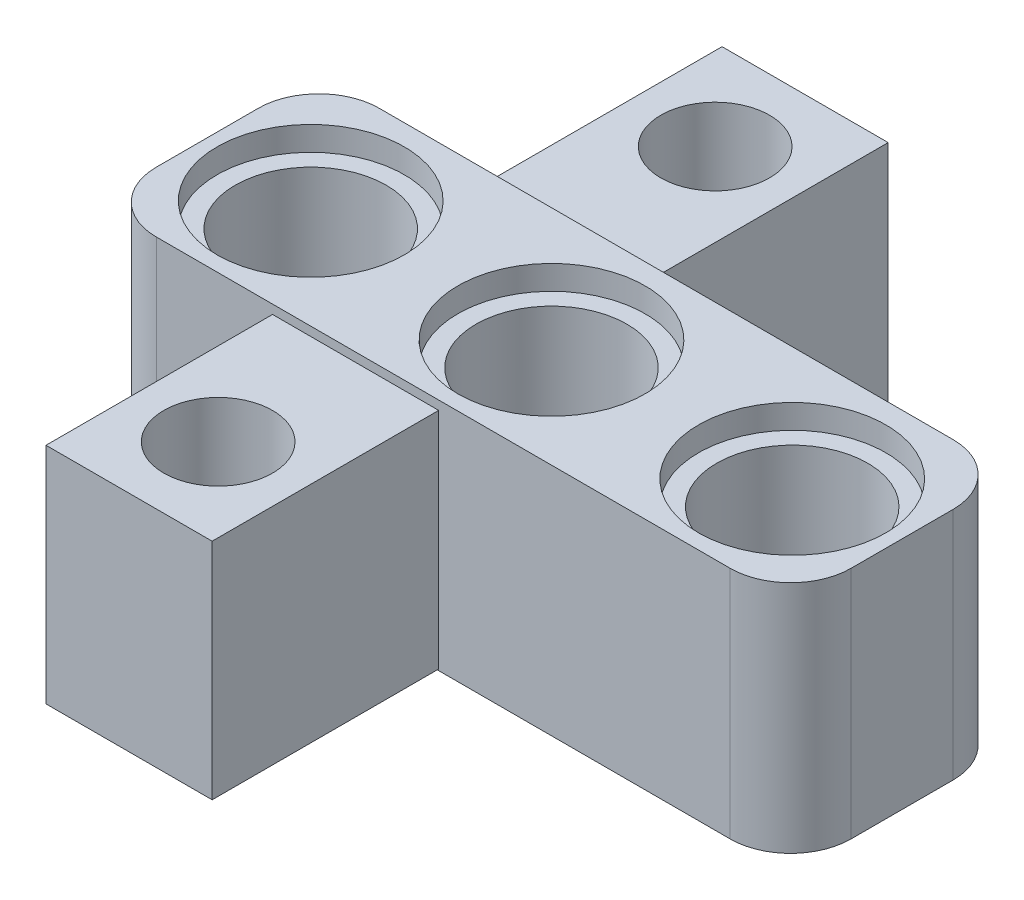
ISO-10303-21;
HEADER;
FILE_DESCRIPTION(('STEP AP214'),'2;1');
FILE_NAME('part.step','',(''),(''),'','','');
FILE_SCHEMA(('AUTOMOTIVE_DESIGN { 1 0 10303 214 1 1 1 1 }'));
ENDSEC;
DATA;
#1=APPLICATION_CONTEXT('core data for automotive mechanical design processes');
#2=APPLICATION_PROTOCOL_DEFINITION('international standard','automotive_design',2000,#1);
#3=PRODUCT_CONTEXT('',#1,'mechanical');
#4=PRODUCT('Part','Part','',(#3));
#5=PRODUCT_RELATED_PRODUCT_CATEGORY('part','',(#4));
#6=PRODUCT_DEFINITION_FORMATION('','',#4);
#7=PRODUCT_DEFINITION_CONTEXT('part definition',#1,'design');
#8=PRODUCT_DEFINITION('design','',#6,#7);
#9=PRODUCT_DEFINITION_SHAPE('','',#8);
#10=(LENGTH_UNIT() NAMED_UNIT(*) SI_UNIT(.MILLI.,.METRE.));
#11=(NAMED_UNIT(*) PLANE_ANGLE_UNIT() SI_UNIT($,.RADIAN.));
#12=(NAMED_UNIT(*) SI_UNIT($,.STERADIAN.) SOLID_ANGLE_UNIT());
#13=UNCERTAINTY_MEASURE_WITH_UNIT(LENGTH_MEASURE(1.E-05),#10,'distance_accuracy_value','');
#14=(GEOMETRIC_REPRESENTATION_CONTEXT(3) GLOBAL_UNCERTAINTY_ASSIGNED_CONTEXT((#13)) GLOBAL_UNIT_ASSIGNED_CONTEXT((#10,
#11,#12)) REPRESENTATION_CONTEXT('',''));
#15=CARTESIAN_POINT('',(0.,0.,0.));
#16=DIRECTION('',(0.,0.,1.));
#17=DIRECTION('',(1.,0.,0.));
#18=AXIS2_PLACEMENT_3D('',#15,#16,#17);
#19=CARTESIAN_POINT('',(0.,7.76,0.));
#20=DIRECTION('',(0.,0.,-1.));
#21=DIRECTION('',(-1.,0.,0.));
#22=AXIS2_PLACEMENT_3D('',#19,#20,#21);
#23=PLANE('',#22);
#24=DIRECTION('',(1.,0.,0.));
#25=VECTOR('',#24,1.);
#26=CARTESIAN_POINT('',(0.,7.76,0.));
#27=LINE('',#26,#25);
#28=CARTESIAN_POINT('',(-21.,7.76,0.));
#29=VERTEX_POINT('',#28);
#30=CARTESIAN_POINT('',(-2.,7.76,0.));
#31=VERTEX_POINT('',#30);
#32=EDGE_CURVE('E238',#29,#31,#27,.T.);
#33=ORIENTED_EDGE('',*,*,#32,.F.);
#34=DIRECTION('',(0.,1.,0.));
#35=VECTOR('',#34,1.);
#36=CARTESIAN_POINT('',(-21.,7.76,0.));
#37=LINE('',#36,#35);
#38=CARTESIAN_POINT('',(-21.,0.,0.));
#39=VERTEX_POINT('',#38);
#40=EDGE_CURVE('E221',#29,#39,#37,.F.);
#41=ORIENTED_EDGE('',*,*,#40,.T.);
#42=DIRECTION('',(1.,0.,0.));
#43=VECTOR('',#42,1.);
#44=CARTESIAN_POINT('',(0.,0.,0.));
#45=LINE('',#44,#43);
#46=CARTESIAN_POINT('',(-2.,0.,0.));
#47=VERTEX_POINT('',#46);
#48=EDGE_CURVE('E249',#39,#47,#45,.T.);
#49=ORIENTED_EDGE('',*,*,#48,.T.);
#50=DIRECTION('',(0.,-1.,0.));
#51=VECTOR('',#50,1.);
#52=CARTESIAN_POINT('',(-2.,7.76,0.));
#53=LINE('',#52,#51);
#54=EDGE_CURVE('E232',#47,#31,#53,.F.);
#55=ORIENTED_EDGE('',*,*,#54,.T.);
#56=EDGE_LOOP('',(#33,#41,#49,#55));
#57=FACE_BOUND('',#56,.T.);
#58=DIRECTION('',(0.,-1.,0.));
#59=VECTOR('',#58,1.);
#60=CARTESIAN_POINT('',(-17.15,7.46280802617594,0.));
#61=LINE('',#60,#59);
#62=CARTESIAN_POINT('',(-17.15,7.46280802617594,0.));
#63=VERTEX_POINT('',#62);
#64=CARTESIAN_POINT('',(-17.15,0.0473093664368207,0.));
#65=VERTEX_POINT('',#64);
#66=EDGE_CURVE('E361',#63,#65,#61,.T.);
#67=ORIENTED_EDGE('',*,*,#66,.F.);
#68=DIRECTION('',(-1.,0.,0.));
#69=VECTOR('',#68,1.);
#70=CARTESIAN_POINT('',(-17.15,7.46280802617594,0.));
#71=LINE('',#70,#69);
#72=CARTESIAN_POINT('',(-11.65,7.46280802617594,0.));
#73=VERTEX_POINT('',#72);
#74=EDGE_CURVE('E353',#73,#63,#71,.T.);
#75=ORIENTED_EDGE('',*,*,#74,.F.);
#76=DIRECTION('',(0.,1.,0.));
#77=VECTOR('',#76,1.);
#78=CARTESIAN_POINT('',(-11.65,7.46280802617594,0.));
#79=LINE('',#78,#77);
#80=CARTESIAN_POINT('',(-11.65,0.0473093664368207,0.));
#81=VERTEX_POINT('',#80);
#82=EDGE_CURVE('E357',#81,#73,#79,.T.);
#83=ORIENTED_EDGE('',*,*,#82,.F.);
#84=DIRECTION('',(1.,0.,0.));
#85=VECTOR('',#84,1.);
#86=CARTESIAN_POINT('',(-17.15,0.0473093664368207,0.));
#87=LINE('',#86,#85);
#88=EDGE_CURVE('E54',#65,#81,#87,.T.);
#89=ORIENTED_EDGE('',*,*,#88,.F.);
#90=EDGE_LOOP('',(#67,#75,#83,#89));
#91=FACE_BOUND('',#90,.T.);
#92=ADVANCED_FACE('F32',(#57,#91),#23,.F.);
#93=CARTESIAN_POINT('',(0.,7.76,-7.38));
#94=DIRECTION('',(0.,0.,1.));
#95=DIRECTION('',(1.,0.,0.));
#96=AXIS2_PLACEMENT_3D('',#93,#94,#95);
#97=PLANE('',#96);
#98=DIRECTION('',(-1.,0.,0.));
#99=VECTOR('',#98,1.);
#100=CARTESIAN_POINT('',(0.,7.76,-7.38));
#101=LINE('',#100,#99);
#102=CARTESIAN_POINT('',(-2.,7.76,-7.38));
#103=VERTEX_POINT('',#102);
#104=CARTESIAN_POINT('',(-21.,7.76,-7.38));
#105=VERTEX_POINT('',#104);
#106=EDGE_CURVE('E263',#103,#105,#101,.T.);
#107=ORIENTED_EDGE('',*,*,#106,.F.);
#108=DIRECTION('',(0.,-1.,0.));
#109=VECTOR('',#108,1.);
#110=CARTESIAN_POINT('',(-2.,7.76,-7.38));
#111=LINE('',#110,#109);
#112=CARTESIAN_POINT('',(-2.,0.,-7.38));
#113=VERTEX_POINT('',#112);
#114=EDGE_CURVE('E202',#103,#113,#111,.T.);
#115=ORIENTED_EDGE('',*,*,#114,.T.);
#116=DIRECTION('',(-1.,0.,0.));
#117=VECTOR('',#116,1.);
#118=CARTESIAN_POINT('',(0.,0.,-7.38));
#119=LINE('',#118,#117);
#120=CARTESIAN_POINT('',(-21.,0.,-7.38));
#121=VERTEX_POINT('',#120);
#122=EDGE_CURVE('E254',#113,#121,#119,.T.);
#123=ORIENTED_EDGE('',*,*,#122,.T.);
#124=DIRECTION('',(0.,1.,0.));
#125=VECTOR('',#124,1.);
#126=CARTESIAN_POINT('',(-21.,7.76,-7.38));
#127=LINE('',#126,#125);
#128=EDGE_CURVE('E213',#121,#105,#127,.T.);
#129=ORIENTED_EDGE('',*,*,#128,.T.);
#130=EDGE_LOOP('',(#107,#115,#123,#129));
#131=FACE_BOUND('',#130,.T.);
#132=DIRECTION('',(0.,-1.,0.));
#133=VECTOR('',#132,1.);
#134=CARTESIAN_POINT('',(-11.65,0.19970973212935,-7.38));
#135=LINE('',#134,#133);
#136=CARTESIAN_POINT('',(-11.65,7.70025145904174,-7.38));
#137=VERTEX_POINT('',#136);
#138=CARTESIAN_POINT('',(-11.65,0.19970973212935,-7.38));
#139=VERTEX_POINT('',#138);
#140=EDGE_CURVE('E331',#137,#139,#135,.T.);
#141=ORIENTED_EDGE('',*,*,#140,.F.);
#142=DIRECTION('',(1.,0.,0.));
#143=VECTOR('',#142,1.);
#144=CARTESIAN_POINT('',(-11.65,7.70025145904174,-7.38));
#145=LINE('',#144,#143);
#146=CARTESIAN_POINT('',(-17.15,7.70025145904174,-7.38));
#147=VERTEX_POINT('',#146);
#148=EDGE_CURVE('E321',#147,#137,#145,.T.);
#149=ORIENTED_EDGE('',*,*,#148,.F.);
#150=DIRECTION('',(0.,1.,0.));
#151=VECTOR('',#150,1.);
#152=CARTESIAN_POINT('',(-17.15,0.19970973212935,-7.38));
#153=LINE('',#152,#151);
#154=CARTESIAN_POINT('',(-17.15,0.19970973212935,-7.38));
#155=VERTEX_POINT('',#154);
#156=EDGE_CURVE('E325',#155,#147,#153,.T.);
#157=ORIENTED_EDGE('',*,*,#156,.F.);
#158=DIRECTION('',(-1.,0.,0.));
#159=VECTOR('',#158,1.);
#160=CARTESIAN_POINT('',(-11.65,0.19970973212935,-7.38));
#161=LINE('',#160,#159);
#162=EDGE_CURVE('E328',#139,#155,#161,.T.);
#163=ORIENTED_EDGE('',*,*,#162,.F.);
#164=EDGE_LOOP('',(#141,#149,#157,#163));
#165=FACE_BOUND('',#164,.T.);
#166=ADVANCED_FACE('F427',(#131,#165),#97,.F.);
#167=CARTESIAN_POINT('',(-2.,7.76,-5.38));
#168=DIRECTION('',(0.,-1.,0.));
#169=DIRECTION('',(0.,0.,-1.));
#170=AXIS2_PLACEMENT_3D('',#167,#168,#169);
#171=CYLINDRICAL_SURFACE('',#170,2.);
#172=ORIENTED_EDGE('',*,*,#114,.F.);
#173=CARTESIAN_POINT('',(-2.,7.76,-5.38));
#174=DIRECTION('',(0.,1.,0.));
#175=DIRECTION('',(0.,0.,1.));
#176=AXIS2_PLACEMENT_3D('',#173,#174,#175);
#177=CIRCLE('',#176,2.);
#178=CARTESIAN_POINT('',(0.,7.76,-5.38));
#179=VERTEX_POINT('',#178);
#180=EDGE_CURVE('E197',#179,#103,#177,.T.);
#181=ORIENTED_EDGE('',*,*,#180,.F.);
#182=DIRECTION('',(0.,-1.,0.));
#183=VECTOR('',#182,1.);
#184=CARTESIAN_POINT('',(0.,7.76,-5.38));
#185=LINE('',#184,#183);
#186=CARTESIAN_POINT('',(0.,0.,-5.38));
#187=VERTEX_POINT('',#186);
#188=EDGE_CURVE('E199',#187,#179,#185,.F.);
#189=ORIENTED_EDGE('',*,*,#188,.F.);
#190=CARTESIAN_POINT('',(-2.,0.,-5.38));
#191=DIRECTION('',(0.,1.,0.));
#192=DIRECTION('',(0.,0.,1.));
#193=AXIS2_PLACEMENT_3D('',#190,#191,#192);
#194=CIRCLE('',#193,2.);
#195=EDGE_CURVE('E183',#113,#187,#194,.F.);
#196=ORIENTED_EDGE('',*,*,#195,.F.);
#197=EDGE_LOOP('',(#172,#181,#189,#196));
#198=FACE_BOUND('',#197,.T.);
#199=ADVANCED_FACE('F34',(#198),#171,.T.);
#200=CARTESIAN_POINT('',(-21.,7.76,-5.38));
#201=DIRECTION('',(0.,1.,0.));
#202=DIRECTION('',(0.,0.,1.));
#203=AXIS2_PLACEMENT_3D('',#200,#201,#202);
#204=CYLINDRICAL_SURFACE('',#203,2.);
#205=ORIENTED_EDGE('',*,*,#128,.F.);
#206=CARTESIAN_POINT('',(-21.,0.,-5.38));
#207=DIRECTION('',(0.,1.,0.));
#208=DIRECTION('',(0.,0.,1.));
#209=AXIS2_PLACEMENT_3D('',#206,#207,#208);
#210=CIRCLE('',#209,2.);
#211=CARTESIAN_POINT('',(-23.,0.,-5.38));
#212=VERTEX_POINT('',#211);
#213=EDGE_CURVE('E207',#212,#121,#210,.F.);
#214=ORIENTED_EDGE('',*,*,#213,.F.);
#215=DIRECTION('',(0.,1.,0.));
#216=VECTOR('',#215,1.);
#217=CARTESIAN_POINT('',(-23.,7.76,-5.38));
#218=LINE('',#217,#216);
#219=CARTESIAN_POINT('',(-23.,7.76,-5.38));
#220=VERTEX_POINT('',#219);
#221=EDGE_CURVE('E210',#220,#212,#218,.F.);
#222=ORIENTED_EDGE('',*,*,#221,.F.);
#223=CARTESIAN_POINT('',(-21.,7.76,-5.38));
#224=DIRECTION('',(0.,1.,0.));
#225=DIRECTION('',(0.,0.,1.));
#226=AXIS2_PLACEMENT_3D('',#223,#224,#225);
#227=CIRCLE('',#226,2.);
#228=EDGE_CURVE('E205',#105,#220,#227,.T.);
#229=ORIENTED_EDGE('',*,*,#228,.F.);
#230=EDGE_LOOP('',(#205,#214,#222,#229));
#231=FACE_BOUND('',#230,.T.);
#232=ADVANCED_FACE('F454',(#231),#204,.T.);
#233=CARTESIAN_POINT('',(-21.,7.76,-2.));
#234=DIRECTION('',(0.,1.,0.));
#235=DIRECTION('',(0.,0.,1.));
#236=AXIS2_PLACEMENT_3D('',#233,#234,#235);
#237=CYLINDRICAL_SURFACE('',#236,2.);
#238=DIRECTION('',(0.,1.,0.));
#239=VECTOR('',#238,1.);
#240=CARTESIAN_POINT('',(-23.,7.76,-2.));
#241=LINE('',#240,#239);
#242=CARTESIAN_POINT('',(-23.,0.,-2.));
#243=VERTEX_POINT('',#242);
#244=CARTESIAN_POINT('',(-23.,7.76,-2.));
#245=VERTEX_POINT('',#244);
#246=EDGE_CURVE('E224',#243,#245,#241,.T.);
#247=ORIENTED_EDGE('',*,*,#246,.F.);
#248=CARTESIAN_POINT('',(-21.,0.,-2.));
#249=DIRECTION('',(0.,1.,0.));
#250=DIRECTION('',(0.,0.,1.));
#251=AXIS2_PLACEMENT_3D('',#248,#249,#250);
#252=CIRCLE('',#251,2.);
#253=EDGE_CURVE('E218',#39,#243,#252,.F.);
#254=ORIENTED_EDGE('',*,*,#253,.F.);
#255=ORIENTED_EDGE('',*,*,#40,.F.);
#256=CARTESIAN_POINT('',(-21.,7.76,-2.));
#257=DIRECTION('',(0.,1.,0.));
#258=DIRECTION('',(0.,0.,1.));
#259=AXIS2_PLACEMENT_3D('',#256,#257,#258);
#260=CIRCLE('',#259,2.);
#261=EDGE_CURVE('E216',#245,#29,#260,.T.);
#262=ORIENTED_EDGE('',*,*,#261,.F.);
#263=EDGE_LOOP('',(#247,#254,#255,#262));
#264=FACE_BOUND('',#263,.T.);
#265=ADVANCED_FACE('F451',(#264),#237,.T.);
#266=CARTESIAN_POINT('',(-2.,7.76,-2.));
#267=DIRECTION('',(0.,-1.,0.));
#268=DIRECTION('',(0.,0.,-1.));
#269=AXIS2_PLACEMENT_3D('',#266,#267,#268);
#270=CYLINDRICAL_SURFACE('',#269,2.);
#271=DIRECTION('',(0.,-1.,0.));
#272=VECTOR('',#271,1.);
#273=CARTESIAN_POINT('',(0.,7.76,-2.));
#274=LINE('',#273,#272);
#275=CARTESIAN_POINT('',(0.,7.76,-2.));
#276=VERTEX_POINT('',#275);
#277=CARTESIAN_POINT('',(0.,0.,-2.));
#278=VERTEX_POINT('',#277);
#279=EDGE_CURVE('E235',#276,#278,#274,.T.);
#280=ORIENTED_EDGE('',*,*,#279,.F.);
#281=CARTESIAN_POINT('',(-2.,7.76,-2.));
#282=DIRECTION('',(0.,1.,0.));
#283=DIRECTION('',(0.,0.,1.));
#284=AXIS2_PLACEMENT_3D('',#281,#282,#283);
#285=CIRCLE('',#284,2.);
#286=EDGE_CURVE('E230',#31,#276,#285,.T.);
#287=ORIENTED_EDGE('',*,*,#286,.F.);
#288=ORIENTED_EDGE('',*,*,#54,.F.);
#289=CARTESIAN_POINT('',(-2.,0.,-2.));
#290=DIRECTION('',(0.,1.,0.));
#291=DIRECTION('',(0.,0.,1.));
#292=AXIS2_PLACEMENT_3D('',#289,#290,#291);
#293=CIRCLE('',#292,2.);
#294=EDGE_CURVE('E227',#278,#47,#293,.F.);
#295=ORIENTED_EDGE('',*,*,#294,.F.);
#296=EDGE_LOOP('',(#280,#287,#288,#295));
#297=FACE_BOUND('',#296,.T.);
#298=ADVANCED_FACE('F447',(#297),#270,.T.);
#299=CARTESIAN_POINT('',(0.,7.76,0.));
#300=DIRECTION('',(-1.,0.,0.));
#301=DIRECTION('',(0.,0.,1.));
#302=AXIS2_PLACEMENT_3D('',#299,#300,#301);
#303=PLANE('',#302);
#304=DIRECTION('',(0.,0.,-1.));
#305=VECTOR('',#304,1.);
#306=CARTESIAN_POINT('',(0.,0.,0.));
#307=LINE('',#306,#305);
#308=EDGE_CURVE('E256',#278,#187,#307,.T.);
#309=ORIENTED_EDGE('',*,*,#308,.T.);
#310=ORIENTED_EDGE('',*,*,#188,.T.);
#311=DIRECTION('',(0.,0.,-1.));
#312=VECTOR('',#311,1.);
#313=CARTESIAN_POINT('',(0.,7.76,0.));
#314=LINE('',#313,#312);
#315=EDGE_CURVE('E251',#276,#179,#314,.T.);
#316=ORIENTED_EDGE('',*,*,#315,.F.);
#317=ORIENTED_EDGE('',*,*,#279,.T.);
#318=EDGE_LOOP('',(#309,#310,#316,#317));
#319=FACE_BOUND('',#318,.T.);
#320=ADVANCED_FACE('F442',(#319),#303,.F.);
#321=CARTESIAN_POINT('',(-23.,7.76,0.));
#322=DIRECTION('',(1.,0.,0.));
#323=DIRECTION('',(0.,0.,-1.));
#324=AXIS2_PLACEMENT_3D('',#321,#322,#323);
#325=PLANE('',#324);
#326=DIRECTION('',(0.,0.,1.));
#327=VECTOR('',#326,1.);
#328=CARTESIAN_POINT('',(-23.,7.76,0.));
#329=LINE('',#328,#327);
#330=EDGE_CURVE('E261',#220,#245,#329,.T.);
#331=ORIENTED_EDGE('',*,*,#330,.F.);
#332=ORIENTED_EDGE('',*,*,#221,.T.);
#333=DIRECTION('',(0.,0.,1.));
#334=VECTOR('',#333,1.);
#335=CARTESIAN_POINT('',(-23.,0.,0.));
#336=LINE('',#335,#334);
#337=EDGE_CURVE('E252',#212,#243,#336,.T.);
#338=ORIENTED_EDGE('',*,*,#337,.T.);
#339=ORIENTED_EDGE('',*,*,#246,.T.);
#340=EDGE_LOOP('',(#331,#332,#338,#339));
#341=FACE_BOUND('',#340,.T.);
#342=ADVANCED_FACE('F439',(#341),#325,.F.);
#343=CARTESIAN_POINT('',(0.,7.76,0.));
#344=DIRECTION('',(0.,1.,0.));
#345=DIRECTION('',(0.,0.,1.));
#346=AXIS2_PLACEMENT_3D('',#343,#344,#345);
#347=PLANE('',#346);
#348=CARTESIAN_POINT('',(-19.4782694052837,7.76,-3.59147010718175));
#349=DIRECTION('',(0.,1.,0.));
#350=DIRECTION('',(0.,0.,1.));
#351=AXIS2_PLACEMENT_3D('',#348,#349,#350);
#352=CIRCLE('',#351,3.1);
#353=CARTESIAN_POINT('',(-19.4782694052837,7.76,-0.49147010718175));
#354=VERTEX_POINT('',#353);
#355=EDGE_CURVE('E296',#354,#354,#352,.T.);
#356=ORIENTED_EDGE('',*,*,#355,.F.);
#357=EDGE_LOOP('',(#356));
#358=FACE_BOUND('',#357,.T.);
#359=CARTESIAN_POINT('',(-11.5082694052837,7.76,-3.59147010718175));
#360=DIRECTION('',(0.,1.,0.));
#361=DIRECTION('',(0.,0.,1.));
#362=AXIS2_PLACEMENT_3D('',#359,#360,#361);
#363=CIRCLE('',#362,3.1);
#364=CARTESIAN_POINT('',(-11.5082694052837,7.76,-0.49147010718175));
#365=VERTEX_POINT('',#364);
#366=EDGE_CURVE('E290',#365,#365,#363,.T.);
#367=ORIENTED_EDGE('',*,*,#366,.F.);
#368=EDGE_LOOP('',(#367));
#369=FACE_BOUND('',#368,.T.);
#370=CARTESIAN_POINT('',(-3.53826940528369,7.76,-3.59147010718175));
#371=DIRECTION('',(0.,1.,0.));
#372=DIRECTION('',(0.,0.,1.));
#373=AXIS2_PLACEMENT_3D('',#370,#371,#372);
#374=CIRCLE('',#373,3.1);
#375=CARTESIAN_POINT('',(-3.53826940528369,7.76,-0.49147010718175));
#376=VERTEX_POINT('',#375);
#377=EDGE_CURVE('E242',#376,#376,#374,.T.);
#378=ORIENTED_EDGE('',*,*,#377,.F.);
#379=EDGE_LOOP('',(#378));
#380=FACE_BOUND('',#379,.T.);
#381=ORIENTED_EDGE('',*,*,#315,.T.);
#382=ORIENTED_EDGE('',*,*,#180,.T.);
#383=ORIENTED_EDGE('',*,*,#106,.T.);
#384=ORIENTED_EDGE('',*,*,#228,.T.);
#385=ORIENTED_EDGE('',*,*,#330,.T.);
#386=ORIENTED_EDGE('',*,*,#261,.T.);
#387=ORIENTED_EDGE('',*,*,#32,.T.);
#388=ORIENTED_EDGE('',*,*,#286,.T.);
#389=EDGE_LOOP('',(#381,#382,#383,#384,#385,#386,#387,#388));
#390=FACE_BOUND('',#389,.T.);
#391=ADVANCED_FACE('F441',(#358,#369,#380,#390),#347,.T.);
#392=CARTESIAN_POINT('',(0.,0.,0.));
#393=DIRECTION('',(0.,1.,0.));
#394=DIRECTION('',(0.,0.,1.));
#395=AXIS2_PLACEMENT_3D('',#392,#393,#394);
#396=PLANE('',#395);
#397=CARTESIAN_POINT('',(-19.5382694052837,0.,-3.69));
#398=DIRECTION('',(0.,-1.,0.));
#399=DIRECTION('',(0.,0.,-1.));
#400=AXIS2_PLACEMENT_3D('',#397,#398,#399);
#401=CIRCLE('',#400,3.1);
#402=CARTESIAN_POINT('',(-19.5382694052837,0.,-6.79));
#403=VERTEX_POINT('',#402);
#404=EDGE_CURVE('E280',#403,#403,#401,.T.);
#405=ORIENTED_EDGE('',*,*,#404,.F.);
#406=EDGE_LOOP('',(#405));
#407=FACE_BOUND('',#406,.T.);
#408=CARTESIAN_POINT('',(-3.53826940528369,0.,-3.68999999999989));
#409=DIRECTION('',(0.,-1.,0.));
#410=DIRECTION('',(0.,0.,-1.));
#411=AXIS2_PLACEMENT_3D('',#408,#409,#410);
#412=CIRCLE('',#411,3.1);
#413=CARTESIAN_POINT('',(-5.78504359883208,0.,-5.82588523174924));
#414=VERTEX_POINT('',#413);
#415=CARTESIAN_POINT('',(-5.78504359883208,0.,-1.55411476825053));
#416=VERTEX_POINT('',#415);
#417=EDGE_CURVE('E267',#414,#416,#412,.T.);
#418=ORIENTED_EDGE('',*,*,#417,.F.);
#419=CARTESIAN_POINT('',(-6.63826940528369,0.,-3.68999999999989));
#420=DIRECTION('',(0.,-1.,0.));
#421=DIRECTION('',(0.,0.,-1.));
#422=AXIS2_PLACEMENT_3D('',#419,#420,#421);
#423=CIRCLE('',#422,2.3);
#424=CARTESIAN_POINT('',(-8.64745307875307,0.,-4.80945565622933));
#425=VERTEX_POINT('',#424);
#426=EDGE_CURVE('E399',#425,#414,#423,.T.);
#427=ORIENTED_EDGE('',*,*,#426,.F.);
#428=CARTESIAN_POINT('',(-11.5382694052837,0.,-3.68999999999994));
#429=DIRECTION('',(0.,-1.,0.));
#430=DIRECTION('',(0.,0.,-1.));
#431=AXIS2_PLACEMENT_3D('',#428,#429,#430);
#432=CIRCLE('',#431,3.1);
#433=CARTESIAN_POINT('',(-8.64745307875309,0.,-2.57054434377049));
#434=VERTEX_POINT('',#433);
#435=EDGE_CURVE('E274',#434,#425,#432,.T.);
#436=ORIENTED_EDGE('',*,*,#435,.F.);
#437=EDGE_CURVE('E189',#416,#434,#423,.T.);
#438=ORIENTED_EDGE('',*,*,#437,.F.);
#439=EDGE_LOOP('',(#418,#427,#436,#438));
#440=FACE_BOUND('',#439,.T.);
#441=ORIENTED_EDGE('',*,*,#122,.F.);
#442=ORIENTED_EDGE('',*,*,#195,.T.);
#443=ORIENTED_EDGE('',*,*,#308,.F.);
#444=ORIENTED_EDGE('',*,*,#294,.T.);
#445=ORIENTED_EDGE('',*,*,#48,.F.);
#446=ORIENTED_EDGE('',*,*,#253,.T.);
#447=ORIENTED_EDGE('',*,*,#337,.F.);
#448=ORIENTED_EDGE('',*,*,#213,.T.);
#449=EDGE_LOOP('',(#441,#442,#443,#444,#445,#446,#447,#448));
#450=FACE_BOUND('',#449,.T.);
#451=ADVANCED_FACE('F409',(#407,#440,#450),#396,.F.);
#452=CARTESIAN_POINT('',(-3.53826940528369,0.8,-3.68999999999989));
#453=DIRECTION('',(0.,-1.,0.));
#454=DIRECTION('',(0.,0.,-1.));
#455=AXIS2_PLACEMENT_3D('',#452,#453,#454);
#456=CYLINDRICAL_SURFACE('',#455,3.1);
#457=CARTESIAN_POINT('',(-3.53826940528369,0.8,-3.68999999999989));
#458=DIRECTION('',(0.,-1.,0.));
#459=DIRECTION('',(0.,0.,-1.));
#460=AXIS2_PLACEMENT_3D('',#457,#458,#459);
#461=CIRCLE('',#460,3.1);
#462=CARTESIAN_POINT('',(-5.78504359883208,0.8,-5.82588523174924));
#463=VERTEX_POINT('',#462);
#464=CARTESIAN_POINT('',(-5.78504359883208,0.8,-1.55411476825053));
#465=VERTEX_POINT('',#464);
#466=EDGE_CURVE('E270',#463,#465,#461,.T.);
#467=ORIENTED_EDGE('',*,*,#466,.F.);
#468=DIRECTION('',(0.,-1.,0.));
#469=VECTOR('',#468,1.);
#470=CARTESIAN_POINT('',(-5.78504359883208,1.25,-5.82588523174924));
#471=LINE('',#470,#469);
#472=EDGE_CURVE('E391',#463,#414,#471,.T.);
#473=ORIENTED_EDGE('',*,*,#472,.T.);
#474=ORIENTED_EDGE('',*,*,#417,.T.);
#475=DIRECTION('',(0.,-1.,0.));
#476=VECTOR('',#475,1.);
#477=CARTESIAN_POINT('',(-5.78504359883208,1.25,-1.55411476825053));
#478=LINE('',#477,#476);
#479=EDGE_CURVE('E395',#416,#465,#478,.F.);
#480=ORIENTED_EDGE('',*,*,#479,.T.);
#481=EDGE_LOOP('',(#467,#473,#474,#480));
#482=FACE_BOUND('',#481,.T.);
#483=ADVANCED_FACE('F413',(#482),#456,.F.);
#484=CARTESIAN_POINT('',(-3.53826940528369,0.8,-3.68999999999989));
#485=DIRECTION('',(0.,-1.,0.));
#486=DIRECTION('',(0.,0.,-1.));
#487=AXIS2_PLACEMENT_3D('',#484,#485,#486);
#488=PLANE('',#487);
#489=CARTESIAN_POINT('',(-6.63826940528369,0.8,-3.68999999999989));
#490=DIRECTION('',(0.,-1.,0.));
#491=DIRECTION('',(0.,0.,-1.));
#492=AXIS2_PLACEMENT_3D('',#489,#490,#491);
#493=CIRCLE('',#492,2.3);
#494=CARTESIAN_POINT('',(-5.18488433820166,0.8,-5.4726025487423));
#495=VERTEX_POINT('',#494);
#496=EDGE_CURVE('E394',#463,#495,#493,.T.);
#497=ORIENTED_EDGE('',*,*,#496,.F.);
#498=ORIENTED_EDGE('',*,*,#466,.T.);
#499=CARTESIAN_POINT('',(-5.30101936751196,0.8,-1.81870036165238));
#500=VERTEX_POINT('',#499);
#501=EDGE_CURVE('E188',#500,#465,#493,.T.);
#502=ORIENTED_EDGE('',*,*,#501,.F.);
#503=CARTESIAN_POINT('',(-3.53826940528369,0.8,-3.59147010718175));
#504=DIRECTION('',(0.,-1.,0.));
#505=DIRECTION('',(0.,0.,-1.));
#506=AXIS2_PLACEMENT_3D('',#503,#504,#505);
#507=CIRCLE('',#506,2.5);
#508=EDGE_CURVE('E194',#495,#500,#507,.T.);
#509=ORIENTED_EDGE('',*,*,#508,.F.);
#510=EDGE_LOOP('',(#497,#498,#502,#509));
#511=FACE_BOUND('',#510,.T.);
#512=ADVANCED_FACE('F416',(#511),#488,.T.);
#513=CARTESIAN_POINT('',(-11.5382694052837,0.8,-3.68999999999994));
#514=DIRECTION('',(0.,-1.,0.));
#515=DIRECTION('',(0.,0.,-1.));
#516=AXIS2_PLACEMENT_3D('',#513,#514,#515);
#517=CYLINDRICAL_SURFACE('',#516,3.1);
#518=CARTESIAN_POINT('',(-11.5382694052837,0.8,-3.68999999999994));
#519=DIRECTION('',(0.,-1.,0.));
#520=DIRECTION('',(0.,0.,-1.));
#521=AXIS2_PLACEMENT_3D('',#518,#519,#520);
#522=CIRCLE('',#521,3.1);
#523=CARTESIAN_POINT('',(-8.64745307875309,0.8,-2.57054434377049));
#524=VERTEX_POINT('',#523);
#525=CARTESIAN_POINT('',(-8.64745307875307,0.8,-4.80945565622933));
#526=VERTEX_POINT('',#525);
#527=EDGE_CURVE('E277',#524,#526,#522,.T.);
#528=ORIENTED_EDGE('',*,*,#527,.F.);
#529=DIRECTION('',(0.,-1.,0.));
#530=VECTOR('',#529,1.);
#531=CARTESIAN_POINT('',(-8.64745307875309,1.25,-2.57054434377049));
#532=LINE('',#531,#530);
#533=EDGE_CURVE('E383',#524,#434,#532,.T.);
#534=ORIENTED_EDGE('',*,*,#533,.T.);
#535=ORIENTED_EDGE('',*,*,#435,.T.);
#536=DIRECTION('',(0.,-1.,0.));
#537=VECTOR('',#536,1.);
#538=CARTESIAN_POINT('',(-8.64745307875307,1.25,-4.80945565622933));
#539=LINE('',#538,#537);
#540=EDGE_CURVE('E386',#425,#526,#539,.F.);
#541=ORIENTED_EDGE('',*,*,#540,.T.);
#542=EDGE_LOOP('',(#528,#534,#535,#541));
#543=FACE_BOUND('',#542,.T.);
#544=ADVANCED_FACE('F408',(#543),#517,.F.);
#545=CARTESIAN_POINT('',(-11.5382694052837,0.8,-3.68999999999994));
#546=DIRECTION('',(0.,-1.,0.));
#547=DIRECTION('',(0.,0.,-1.));
#548=AXIS2_PLACEMENT_3D('',#545,#546,#547);
#549=PLANE('',#548);
#550=CARTESIAN_POINT('',(-6.63826940528369,0.8,-3.68999999999989));
#551=DIRECTION('',(0.,-1.,0.));
#552=DIRECTION('',(0.,0.,-1.));
#553=AXIS2_PLACEMENT_3D('',#550,#551,#552);
#554=CIRCLE('',#553,2.3);
#555=EDGE_CURVE('E389',#524,#526,#554,.T.);
#556=ORIENTED_EDGE('',*,*,#555,.F.);
#557=ORIENTED_EDGE('',*,*,#527,.T.);
#558=EDGE_LOOP('',(#556,#557));
#559=FACE_BOUND('',#558,.T.);
#560=CARTESIAN_POINT('',(-11.5082694052837,0.8,-3.59147010718175));
#561=DIRECTION('',(0.,-1.,0.));
#562=DIRECTION('',(0.,0.,-1.));
#563=AXIS2_PLACEMENT_3D('',#560,#561,#562);
#564=CIRCLE('',#563,2.5);
#565=CARTESIAN_POINT('',(-11.5082694052837,0.8,-6.09147010718175));
#566=VERTEX_POINT('',#565);
#567=EDGE_CURVE('E304',#566,#566,#564,.T.);
#568=ORIENTED_EDGE('',*,*,#567,.F.);
#569=EDGE_LOOP('',(#568));
#570=FACE_BOUND('',#569,.T.);
#571=ADVANCED_FACE('F423',(#559,#570),#549,.T.);
#572=CARTESIAN_POINT('',(-19.5382694052837,0.8,-3.69));
#573=DIRECTION('',(0.,-1.,0.));
#574=DIRECTION('',(0.,0.,-1.));
#575=AXIS2_PLACEMENT_3D('',#572,#573,#574);
#576=CYLINDRICAL_SURFACE('',#575,3.1);
#577=CARTESIAN_POINT('',(-19.5382694052837,0.8,-3.69));
#578=DIRECTION('',(0.,-1.,0.));
#579=DIRECTION('',(0.,0.,-1.));
#580=AXIS2_PLACEMENT_3D('',#577,#578,#579);
#581=CIRCLE('',#580,3.1);
#582=CARTESIAN_POINT('',(-19.5382694052837,0.8,-6.79));
#583=VERTEX_POINT('',#582);
#584=EDGE_CURVE('E259',#583,#583,#581,.T.);
#585=ORIENTED_EDGE('',*,*,#584,.F.);
#586=EDGE_LOOP('',(#585));
#587=FACE_BOUND('',#586,.T.);
#588=ORIENTED_EDGE('',*,*,#404,.T.);
#589=EDGE_LOOP('',(#588));
#590=FACE_BOUND('',#589,.T.);
#591=ADVANCED_FACE('F507',(#587,#590),#576,.F.);
#592=CARTESIAN_POINT('',(-19.5382694052837,0.8,-3.69));
#593=DIRECTION('',(0.,-1.,0.));
#594=DIRECTION('',(0.,0.,-1.));
#595=AXIS2_PLACEMENT_3D('',#592,#593,#594);
#596=PLANE('',#595);
#597=CARTESIAN_POINT('',(-19.4782694052837,0.8,-3.59147010718175));
#598=DIRECTION('',(0.,-1.,0.));
#599=DIRECTION('',(0.,0.,-1.));
#600=AXIS2_PLACEMENT_3D('',#597,#598,#599);
#601=CIRCLE('',#600,2.5);
#602=CARTESIAN_POINT('',(-19.4782694052837,0.8,-6.09147010718175));
#603=VERTEX_POINT('',#602);
#604=EDGE_CURVE('E301',#603,#603,#601,.T.);
#605=ORIENTED_EDGE('',*,*,#604,.F.);
#606=EDGE_LOOP('',(#605));
#607=FACE_BOUND('',#606,.T.);
#608=ORIENTED_EDGE('',*,*,#584,.T.);
#609=EDGE_LOOP('',(#608));
#610=FACE_BOUND('',#609,.T.);
#611=ADVANCED_FACE('F497',(#607,#610),#596,.T.);
#612=CARTESIAN_POINT('',(-3.53826940528369,6.96,-3.59147010718175));
#613=DIRECTION('',(0.,1.,0.));
#614=DIRECTION('',(0.,0.,1.));
#615=AXIS2_PLACEMENT_3D('',#612,#613,#614);
#616=CYLINDRICAL_SURFACE('',#615,3.1);
#617=CARTESIAN_POINT('',(-3.53826940528369,6.96,-3.59147010718175));
#618=DIRECTION('',(0.,1.,0.));
#619=DIRECTION('',(0.,0.,1.));
#620=AXIS2_PLACEMENT_3D('',#617,#618,#619);
#621=CIRCLE('',#620,3.1);
#622=CARTESIAN_POINT('',(-3.53826940528369,6.96,-0.49147010718175));
#623=VERTEX_POINT('',#622);
#624=EDGE_CURVE('E287',#623,#623,#621,.T.);
#625=ORIENTED_EDGE('',*,*,#624,.F.);
#626=EDGE_LOOP('',(#625));
#627=FACE_BOUND('',#626,.T.);
#628=ORIENTED_EDGE('',*,*,#377,.T.);
#629=EDGE_LOOP('',(#628));
#630=FACE_BOUND('',#629,.T.);
#631=ADVANCED_FACE('F494',(#627,#630),#616,.F.);
#632=CARTESIAN_POINT('',(-3.53826940528369,6.96,-3.59147010718175));
#633=DIRECTION('',(0.,1.,0.));
#634=DIRECTION('',(0.,0.,1.));
#635=AXIS2_PLACEMENT_3D('',#632,#633,#634);
#636=PLANE('',#635);
#637=CARTESIAN_POINT('',(-3.53826940528369,6.96,-3.59147010718175));
#638=DIRECTION('',(0.,1.,0.));
#639=DIRECTION('',(0.,0.,1.));
#640=AXIS2_PLACEMENT_3D('',#637,#638,#639);
#641=CIRCLE('',#640,2.5);
#642=CARTESIAN_POINT('',(-3.53826940528369,6.96,-1.09147010718175));
#643=VERTEX_POINT('',#642);
#644=EDGE_CURVE('E239',#643,#643,#641,.T.);
#645=ORIENTED_EDGE('',*,*,#644,.F.);
#646=EDGE_LOOP('',(#645));
#647=FACE_BOUND('',#646,.T.);
#648=ORIENTED_EDGE('',*,*,#624,.T.);
#649=EDGE_LOOP('',(#648));
#650=FACE_BOUND('',#649,.T.);
#651=ADVANCED_FACE('F496',(#647,#650),#636,.T.);
#652=CARTESIAN_POINT('',(-11.5082694052837,6.96,-3.59147010718175));
#653=DIRECTION('',(0.,1.,0.));
#654=DIRECTION('',(0.,0.,1.));
#655=AXIS2_PLACEMENT_3D('',#652,#653,#654);
#656=CYLINDRICAL_SURFACE('',#655,3.1);
#657=CARTESIAN_POINT('',(-11.5082694052837,6.96,-3.59147010718175));
#658=DIRECTION('',(0.,1.,0.));
#659=DIRECTION('',(0.,0.,1.));
#660=AXIS2_PLACEMENT_3D('',#657,#658,#659);
#661=CIRCLE('',#660,3.1);
#662=CARTESIAN_POINT('',(-11.5082694052837,6.96,-0.49147010718175));
#663=VERTEX_POINT('',#662);
#664=EDGE_CURVE('E293',#663,#663,#661,.T.);
#665=ORIENTED_EDGE('',*,*,#664,.F.);
#666=EDGE_LOOP('',(#665));
#667=FACE_BOUND('',#666,.T.);
#668=ORIENTED_EDGE('',*,*,#366,.T.);
#669=EDGE_LOOP('',(#668));
#670=FACE_BOUND('',#669,.T.);
#671=ADVANCED_FACE('F504',(#667,#670),#656,.F.);
#672=CARTESIAN_POINT('',(-11.5082694052837,6.96,-3.59147010718175));
#673=DIRECTION('',(0.,1.,0.));
#674=DIRECTION('',(0.,0.,1.));
#675=AXIS2_PLACEMENT_3D('',#672,#673,#674);
#676=PLANE('',#675);
#677=CARTESIAN_POINT('',(-11.5082694052837,6.96,-3.59147010718175));
#678=DIRECTION('',(0.,1.,0.));
#679=DIRECTION('',(0.,0.,1.));
#680=AXIS2_PLACEMENT_3D('',#677,#678,#679);
#681=CIRCLE('',#680,2.5);
#682=CARTESIAN_POINT('',(-11.5082694052837,6.96,-1.09147010718175));
#683=VERTEX_POINT('',#682);
#684=EDGE_CURVE('E243',#683,#683,#681,.T.);
#685=ORIENTED_EDGE('',*,*,#684,.F.);
#686=EDGE_LOOP('',(#685));
#687=FACE_BOUND('',#686,.T.);
#688=ORIENTED_EDGE('',*,*,#664,.T.);
#689=EDGE_LOOP('',(#688));
#690=FACE_BOUND('',#689,.T.);
#691=ADVANCED_FACE('F546',(#687,#690),#676,.T.);
#692=CARTESIAN_POINT('',(-19.4782694052837,6.96,-3.59147010718175));
#693=DIRECTION('',(0.,1.,0.));
#694=DIRECTION('',(0.,0.,1.));
#695=AXIS2_PLACEMENT_3D('',#692,#693,#694);
#696=CYLINDRICAL_SURFACE('',#695,3.1);
#697=CARTESIAN_POINT('',(-19.4782694052837,6.96,-3.59147010718175));
#698=DIRECTION('',(0.,1.,0.));
#699=DIRECTION('',(0.,0.,1.));
#700=AXIS2_PLACEMENT_3D('',#697,#698,#699);
#701=CIRCLE('',#700,3.1);
#702=CARTESIAN_POINT('',(-19.4782694052837,6.96,-0.49147010718175));
#703=VERTEX_POINT('',#702);
#704=EDGE_CURVE('E271',#703,#703,#701,.T.);
#705=ORIENTED_EDGE('',*,*,#704,.F.);
#706=EDGE_LOOP('',(#705));
#707=FACE_BOUND('',#706,.T.);
#708=ORIENTED_EDGE('',*,*,#355,.T.);
#709=EDGE_LOOP('',(#708));
#710=FACE_BOUND('',#709,.T.);
#711=ADVANCED_FACE('F542',(#707,#710),#696,.F.);
#712=CARTESIAN_POINT('',(-19.4782694052837,6.96,-3.59147010718175));
#713=DIRECTION('',(0.,1.,0.));
#714=DIRECTION('',(0.,0.,1.));
#715=AXIS2_PLACEMENT_3D('',#712,#713,#714);
#716=PLANE('',#715);
#717=CARTESIAN_POINT('',(-19.4782694052837,6.96,-3.59147010718175));
#718=DIRECTION('',(0.,1.,0.));
#719=DIRECTION('',(0.,0.,1.));
#720=AXIS2_PLACEMENT_3D('',#717,#718,#719);
#721=CIRCLE('',#720,2.5);
#722=CARTESIAN_POINT('',(-19.4782694052837,6.96,-1.09147010718175));
#723=VERTEX_POINT('',#722);
#724=EDGE_CURVE('E246',#723,#723,#721,.T.);
#725=ORIENTED_EDGE('',*,*,#724,.F.);
#726=EDGE_LOOP('',(#725));
#727=FACE_BOUND('',#726,.T.);
#728=ORIENTED_EDGE('',*,*,#704,.T.);
#729=EDGE_LOOP('',(#728));
#730=FACE_BOUND('',#729,.T.);
#731=ADVANCED_FACE('F535',(#727,#730),#716,.T.);
#732=CARTESIAN_POINT('',(-19.4782694052837,7.76,-3.59147010718175));
#733=DIRECTION('',(0.,-1.,0.));
#734=DIRECTION('',(0.,0.,-1.));
#735=AXIS2_PLACEMENT_3D('',#732,#733,#734);
#736=CYLINDRICAL_SURFACE('',#735,2.5);
#737=ORIENTED_EDGE('',*,*,#724,.T.);
#738=EDGE_LOOP('',(#737));
#739=FACE_BOUND('',#738,.T.);
#740=ORIENTED_EDGE('',*,*,#604,.T.);
#741=EDGE_LOOP('',(#740));
#742=FACE_BOUND('',#741,.T.);
#743=ADVANCED_FACE('F525',(#739,#742),#736,.F.);
#744=CARTESIAN_POINT('',(-11.5082694052837,7.76,-3.59147010718175));
#745=DIRECTION('',(0.,-1.,0.));
#746=DIRECTION('',(0.,0.,-1.));
#747=AXIS2_PLACEMENT_3D('',#744,#745,#746);
#748=CYLINDRICAL_SURFACE('',#747,2.5);
#749=ORIENTED_EDGE('',*,*,#684,.T.);
#750=EDGE_LOOP('',(#749));
#751=FACE_BOUND('',#750,.T.);
#752=ORIENTED_EDGE('',*,*,#567,.T.);
#753=EDGE_LOOP('',(#752));
#754=FACE_BOUND('',#753,.T.);
#755=ADVANCED_FACE('F523',(#751,#754),#748,.F.);
#756=CARTESIAN_POINT('',(-3.53826940528369,7.76,-3.59147010718175));
#757=DIRECTION('',(0.,-1.,0.));
#758=DIRECTION('',(0.,0.,-1.));
#759=AXIS2_PLACEMENT_3D('',#756,#757,#758);
#760=CYLINDRICAL_SURFACE('',#759,2.5);
#761=ORIENTED_EDGE('',*,*,#644,.T.);
#762=EDGE_LOOP('',(#761));
#763=FACE_BOUND('',#762,.T.);
#764=CARTESIAN_POINT('',(-3.53826940528369,2.5,-3.59147010718175));
#765=DIRECTION('',(0.,-1.,0.));
#766=DIRECTION('',(0.,0.,-1.));
#767=AXIS2_PLACEMENT_3D('',#764,#765,#766);
#768=CIRCLE('',#767,2.5);
#769=CARTESIAN_POINT('',(-5.18488433820166,2.5,-5.4726025487423));
#770=VERTEX_POINT('',#769);
#771=CARTESIAN_POINT('',(-5.30101936751196,2.5,-1.81870036165238));
#772=VERTEX_POINT('',#771);
#773=EDGE_CURVE('E179',#770,#772,#768,.F.);
#774=ORIENTED_EDGE('',*,*,#773,.F.);
#775=DIRECTION('',(0.,-1.,0.));
#776=VECTOR('',#775,1.);
#777=CARTESIAN_POINT('',(-5.18488433820166,1.25,-5.4726025487423));
#778=LINE('',#777,#776);
#779=EDGE_CURVE('E11',#770,#495,#778,.T.);
#780=ORIENTED_EDGE('',*,*,#779,.T.);
#781=ORIENTED_EDGE('',*,*,#508,.T.);
#782=DIRECTION('',(0.,-1.,0.));
#783=VECTOR('',#782,1.);
#784=CARTESIAN_POINT('',(-5.30101936751196,1.25,-1.81870036165238));
#785=LINE('',#784,#783);
#786=EDGE_CURVE('E40',#500,#772,#785,.F.);
#787=ORIENTED_EDGE('',*,*,#786,.T.);
#788=EDGE_LOOP('',(#774,#780,#781,#787));
#789=FACE_BOUND('',#788,.T.);
#790=ADVANCED_FACE('F192',(#763,#789),#760,.F.);
#791=CARTESIAN_POINT('',(-11.65,0.19970973212935,-14.88));
#792=DIRECTION('',(-1.,0.,0.));
#793=DIRECTION('',(0.,0.,1.));
#794=AXIS2_PLACEMENT_3D('',#791,#792,#793);
#795=PLANE('',#794);
#796=ORIENTED_EDGE('',*,*,#140,.T.);
#797=DIRECTION('',(0.,0.,1.));
#798=VECTOR('',#797,1.);
#799=CARTESIAN_POINT('',(-11.65,0.19970973212935,-14.88));
#800=LINE('',#799,#798);
#801=CARTESIAN_POINT('',(-11.65,0.19970973212935,-14.88));
#802=VERTEX_POINT('',#801);
#803=EDGE_CURVE('E305',#802,#139,#800,.T.);
#804=ORIENTED_EDGE('',*,*,#803,.F.);
#805=DIRECTION('',(0.,-1.,0.));
#806=VECTOR('',#805,1.);
#807=CARTESIAN_POINT('',(-11.65,0.19970973212935,-14.88));
#808=LINE('',#807,#806);
#809=CARTESIAN_POINT('',(-11.65,7.70025145904174,-14.88));
#810=VERTEX_POINT('',#809);
#811=EDGE_CURVE('E324',#810,#802,#808,.T.);
#812=ORIENTED_EDGE('',*,*,#811,.F.);
#813=DIRECTION('',(0.,0.,1.));
#814=VECTOR('',#813,1.);
#815=CARTESIAN_POINT('',(-11.65,7.70025145904174,-14.88));
#816=LINE('',#815,#814);
#817=EDGE_CURVE('E317',#810,#137,#816,.T.);
#818=ORIENTED_EDGE('',*,*,#817,.T.);
#819=EDGE_LOOP('',(#796,#804,#812,#818));
#820=FACE_BOUND('',#819,.T.);
#821=ADVANCED_FACE('F532',(#820),#795,.F.);
#822=CARTESIAN_POINT('',(-11.65,0.19970973212935,-14.88));
#823=DIRECTION('',(0.,1.,0.));
#824=DIRECTION('',(0.,0.,1.));
#825=AXIS2_PLACEMENT_3D('',#822,#823,#824);
#826=PLANE('',#825);
#827=CARTESIAN_POINT('',(-14.4,0.19970973212935,-11.9025050554882));
#828=DIRECTION('',(0.,1.,0.));
#829=DIRECTION('',(0.,0.,1.));
#830=AXIS2_PLACEMENT_3D('',#827,#828,#829);
#831=CIRCLE('',#830,1.8);
#832=CARTESIAN_POINT('',(-14.4,0.19970973212935,-10.1025050554882));
#833=VERTEX_POINT('',#832);
#834=EDGE_CURVE('E364',#833,#833,#831,.T.);
#835=ORIENTED_EDGE('',*,*,#834,.T.);
#836=EDGE_LOOP('',(#835));
#837=FACE_BOUND('',#836,.T.);
#838=ORIENTED_EDGE('',*,*,#162,.T.);
#839=DIRECTION('',(0.,0.,1.));
#840=VECTOR('',#839,1.);
#841=CARTESIAN_POINT('',(-17.15,0.19970973212935,-14.88));
#842=LINE('',#841,#840);
#843=CARTESIAN_POINT('',(-17.15,0.19970973212935,-14.88));
#844=VERTEX_POINT('',#843);
#845=EDGE_CURVE('E311',#844,#155,#842,.T.);
#846=ORIENTED_EDGE('',*,*,#845,.F.);
#847=DIRECTION('',(-1.,0.,0.));
#848=VECTOR('',#847,1.);
#849=CARTESIAN_POINT('',(-11.65,0.19970973212935,-14.88));
#850=LINE('',#849,#848);
#851=EDGE_CURVE('E338',#802,#844,#850,.T.);
#852=ORIENTED_EDGE('',*,*,#851,.F.);
#853=ORIENTED_EDGE('',*,*,#803,.T.);
#854=EDGE_LOOP('',(#838,#846,#852,#853));
#855=FACE_BOUND('',#854,.T.);
#856=ADVANCED_FACE('F635',(#837,#855),#826,.F.);
#857=CARTESIAN_POINT('',(-17.15,0.19970973212935,-14.88));
#858=DIRECTION('',(1.,0.,0.));
#859=DIRECTION('',(0.,0.,-1.));
#860=AXIS2_PLACEMENT_3D('',#857,#858,#859);
#861=PLANE('',#860);
#862=ORIENTED_EDGE('',*,*,#156,.T.);
#863=DIRECTION('',(0.,0.,1.));
#864=VECTOR('',#863,1.);
#865=CARTESIAN_POINT('',(-17.15,7.70025145904174,-14.88));
#866=LINE('',#865,#864);
#867=CARTESIAN_POINT('',(-17.15,7.70025145904174,-14.88));
#868=VERTEX_POINT('',#867);
#869=EDGE_CURVE('E314',#868,#147,#866,.T.);
#870=ORIENTED_EDGE('',*,*,#869,.F.);
#871=DIRECTION('',(0.,1.,0.));
#872=VECTOR('',#871,1.);
#873=CARTESIAN_POINT('',(-17.15,0.19970973212935,-14.88));
#874=LINE('',#873,#872);
#875=EDGE_CURVE('E336',#844,#868,#874,.T.);
#876=ORIENTED_EDGE('',*,*,#875,.F.);
#877=ORIENTED_EDGE('',*,*,#845,.T.);
#878=EDGE_LOOP('',(#862,#870,#876,#877));
#879=FACE_BOUND('',#878,.T.);
#880=ADVANCED_FACE('F642',(#879),#861,.F.);
#881=CARTESIAN_POINT('',(-11.65,7.70025145904174,-14.88));
#882=DIRECTION('',(0.,-1.,0.));
#883=DIRECTION('',(0.,0.,-1.));
#884=AXIS2_PLACEMENT_3D('',#881,#882,#883);
#885=PLANE('',#884);
#886=CARTESIAN_POINT('',(-14.4,7.70025145904174,-11.9025050554882));
#887=DIRECTION('',(0.,1.,0.));
#888=DIRECTION('',(0.,0.,1.));
#889=AXIS2_PLACEMENT_3D('',#886,#887,#888);
#890=CIRCLE('',#889,1.8);
#891=CARTESIAN_POINT('',(-14.4,7.70025145904174,-10.1025050554882));
#892=VERTEX_POINT('',#891);
#893=EDGE_CURVE('E374',#892,#892,#890,.T.);
#894=ORIENTED_EDGE('',*,*,#893,.F.);
#895=EDGE_LOOP('',(#894));
#896=FACE_BOUND('',#895,.T.);
#897=ORIENTED_EDGE('',*,*,#148,.T.);
#898=ORIENTED_EDGE('',*,*,#817,.F.);
#899=DIRECTION('',(1.,0.,0.));
#900=VECTOR('',#899,1.);
#901=CARTESIAN_POINT('',(-11.65,7.70025145904174,-14.88));
#902=LINE('',#901,#900);
#903=EDGE_CURVE('E320',#868,#810,#902,.T.);
#904=ORIENTED_EDGE('',*,*,#903,.F.);
#905=ORIENTED_EDGE('',*,*,#869,.T.);
#906=EDGE_LOOP('',(#897,#898,#904,#905));
#907=FACE_BOUND('',#906,.T.);
#908=ADVANCED_FACE('F647',(#896,#907),#885,.F.);
#909=CARTESIAN_POINT('',(0.,0.,-14.88));
#910=DIRECTION('',(0.,0.,1.));
#911=DIRECTION('',(1.,0.,0.));
#912=AXIS2_PLACEMENT_3D('',#909,#910,#911);
#913=PLANE('',#912);
#914=ORIENTED_EDGE('',*,*,#811,.T.);
#915=ORIENTED_EDGE('',*,*,#851,.T.);
#916=ORIENTED_EDGE('',*,*,#875,.T.);
#917=ORIENTED_EDGE('',*,*,#903,.T.);
#918=EDGE_LOOP('',(#914,#915,#916,#917));
#919=FACE_BOUND('',#918,.T.);
#920=ADVANCED_FACE('F655',(#919),#913,.F.);
#921=CARTESIAN_POINT('',(-17.15,7.46280802617594,7.5));
#922=DIRECTION('',(1.,0.,0.));
#923=DIRECTION('',(0.,0.,-1.));
#924=AXIS2_PLACEMENT_3D('',#921,#922,#923);
#925=PLANE('',#924);
#926=ORIENTED_EDGE('',*,*,#66,.T.);
#927=DIRECTION('',(0.,0.,-1.));
#928=VECTOR('',#927,1.);
#929=CARTESIAN_POINT('',(-17.15,0.0473093664368207,7.5));
#930=LINE('',#929,#928);
#931=CARTESIAN_POINT('',(-17.15,0.0473093664368207,7.5));
#932=VERTEX_POINT('',#931);
#933=EDGE_CURVE('E334',#932,#65,#930,.T.);
#934=ORIENTED_EDGE('',*,*,#933,.F.);
#935=DIRECTION('',(0.,-1.,0.));
#936=VECTOR('',#935,1.);
#937=CARTESIAN_POINT('',(-17.15,7.46280802617594,7.5));
#938=LINE('',#937,#936);
#939=CARTESIAN_POINT('',(-17.15,7.46280802617594,7.5));
#940=VERTEX_POINT('',#939);
#941=EDGE_CURVE('E356',#940,#932,#938,.T.);
#942=ORIENTED_EDGE('',*,*,#941,.F.);
#943=DIRECTION('',(0.,0.,-1.));
#944=VECTOR('',#943,1.);
#945=CARTESIAN_POINT('',(-17.15,7.46280802617594,7.5));
#946=LINE('',#945,#944);
#947=EDGE_CURVE('E349',#940,#63,#946,.T.);
#948=ORIENTED_EDGE('',*,*,#947,.T.);
#949=EDGE_LOOP('',(#926,#934,#942,#948));
#950=FACE_BOUND('',#949,.T.);
#951=ADVANCED_FACE('F659',(#950),#925,.F.);
#952=CARTESIAN_POINT('',(-17.15,0.0473093664368207,7.5));
#953=DIRECTION('',(0.,1.,0.));
#954=DIRECTION('',(0.,0.,1.));
#955=AXIS2_PLACEMENT_3D('',#952,#953,#954);
#956=PLANE('',#955);
#957=CARTESIAN_POINT('',(-14.4,0.0473093664368207,4.55066123583947));
#958=DIRECTION('',(0.,1.,0.));
#959=DIRECTION('',(0.,0.,1.));
#960=AXIS2_PLACEMENT_3D('',#957,#958,#959);
#961=CIRCLE('',#960,1.8);
#962=CARTESIAN_POINT('',(-14.4,0.0473093664368207,6.35066123583947));
#963=VERTEX_POINT('',#962);
#964=EDGE_CURVE('E377',#963,#963,#961,.T.);
#965=ORIENTED_EDGE('',*,*,#964,.T.);
#966=EDGE_LOOP('',(#965));
#967=FACE_BOUND('',#966,.T.);
#968=ORIENTED_EDGE('',*,*,#88,.T.);
#969=DIRECTION('',(0.,0.,-1.));
#970=VECTOR('',#969,1.);
#971=CARTESIAN_POINT('',(-11.65,0.0473093664368207,7.5));
#972=LINE('',#971,#970);
#973=CARTESIAN_POINT('',(-11.65,0.0473093664368207,7.5));
#974=VERTEX_POINT('',#973);
#975=EDGE_CURVE('E343',#974,#81,#972,.T.);
#976=ORIENTED_EDGE('',*,*,#975,.F.);
#977=DIRECTION('',(1.,0.,0.));
#978=VECTOR('',#977,1.);
#979=CARTESIAN_POINT('',(-17.15,0.0473093664368207,7.5));
#980=LINE('',#979,#978);
#981=EDGE_CURVE('E368',#932,#974,#980,.T.);
#982=ORIENTED_EDGE('',*,*,#981,.F.);
#983=ORIENTED_EDGE('',*,*,#933,.T.);
#984=EDGE_LOOP('',(#968,#976,#982,#983));
#985=FACE_BOUND('',#984,.T.);
#986=ADVANCED_FACE('F674',(#967,#985),#956,.F.);
#987=CARTESIAN_POINT('',(-11.65,7.46280802617594,7.5));
#988=DIRECTION('',(-1.,0.,0.));
#989=DIRECTION('',(0.,-1.,0.));
#990=AXIS2_PLACEMENT_3D('',#987,#988,#989);
#991=PLANE('',#990);
#992=ORIENTED_EDGE('',*,*,#82,.T.);
#993=DIRECTION('',(0.,0.,-1.));
#994=VECTOR('',#993,1.);
#995=CARTESIAN_POINT('',(-11.65,7.46280802617594,7.5));
#996=LINE('',#995,#994);
#997=CARTESIAN_POINT('',(-11.65,7.46280802617594,7.5));
#998=VERTEX_POINT('',#997);
#999=EDGE_CURVE('E346',#998,#73,#996,.T.);
#1000=ORIENTED_EDGE('',*,*,#999,.F.);
#1001=DIRECTION('',(0.,1.,0.));
#1002=VECTOR('',#1001,1.);
#1003=CARTESIAN_POINT('',(-11.65,7.46280802617594,7.5));
#1004=LINE('',#1003,#1002);
#1005=EDGE_CURVE('E366',#974,#998,#1004,.T.);
#1006=ORIENTED_EDGE('',*,*,#1005,.F.);
#1007=ORIENTED_EDGE('',*,*,#975,.T.);
#1008=EDGE_LOOP('',(#992,#1000,#1006,#1007));
#1009=FACE_BOUND('',#1008,.T.);
#1010=ADVANCED_FACE('F682',(#1009),#991,.F.);
#1011=CARTESIAN_POINT('',(-17.15,7.46280802617594,7.5));
#1012=DIRECTION('',(0.,-1.,0.));
#1013=DIRECTION('',(0.,0.,-1.));
#1014=AXIS2_PLACEMENT_3D('',#1011,#1012,#1013);
#1015=PLANE('',#1014);
#1016=CARTESIAN_POINT('',(-14.4,7.46280802617594,4.55066123583947));
#1017=DIRECTION('',(0.,1.,0.));
#1018=DIRECTION('',(0.,0.,1.));
#1019=AXIS2_PLACEMENT_3D('',#1016,#1017,#1018);
#1020=CIRCLE('',#1019,1.8);
#1021=CARTESIAN_POINT('',(-14.4,7.46280802617594,6.35066123583947));
#1022=VERTEX_POINT('',#1021);
#1023=EDGE_CURVE('E380',#1022,#1022,#1020,.T.);
#1024=ORIENTED_EDGE('',*,*,#1023,.F.);
#1025=EDGE_LOOP('',(#1024));
#1026=FACE_BOUND('',#1025,.T.);
#1027=ORIENTED_EDGE('',*,*,#74,.T.);
#1028=ORIENTED_EDGE('',*,*,#947,.F.);
#1029=DIRECTION('',(-1.,0.,0.));
#1030=VECTOR('',#1029,1.);
#1031=CARTESIAN_POINT('',(-17.15,7.46280802617594,7.5));
#1032=LINE('',#1031,#1030);
#1033=EDGE_CURVE('E352',#998,#940,#1032,.T.);
#1034=ORIENTED_EDGE('',*,*,#1033,.F.);
#1035=ORIENTED_EDGE('',*,*,#999,.T.);
#1036=EDGE_LOOP('',(#1027,#1028,#1034,#1035));
#1037=FACE_BOUND('',#1036,.T.);
#1038=ADVANCED_FACE('F687',(#1026,#1037),#1015,.F.);
#1039=CARTESIAN_POINT('',(0.,0.,7.5));
#1040=DIRECTION('',(0.,0.,1.));
#1041=DIRECTION('',(1.,0.,0.));
#1042=AXIS2_PLACEMENT_3D('',#1039,#1040,#1041);
#1043=PLANE('',#1042);
#1044=ORIENTED_EDGE('',*,*,#941,.T.);
#1045=ORIENTED_EDGE('',*,*,#981,.T.);
#1046=ORIENTED_EDGE('',*,*,#1005,.T.);
#1047=ORIENTED_EDGE('',*,*,#1033,.T.);
#1048=EDGE_LOOP('',(#1044,#1045,#1046,#1047));
#1049=FACE_BOUND('',#1048,.T.);
#1050=ADVANCED_FACE('F695',(#1049),#1043,.T.);
#1051=CARTESIAN_POINT('',(-14.4,-12.8997485409583,-11.9025050554882));
#1052=DIRECTION('',(0.,1.,0.));
#1053=DIRECTION('',(0.,0.,1.));
#1054=AXIS2_PLACEMENT_3D('',#1051,#1052,#1053);
#1055=CYLINDRICAL_SURFACE('',#1054,1.8);
#1056=ORIENTED_EDGE('',*,*,#893,.T.);
#1057=EDGE_LOOP('',(#1056));
#1058=FACE_BOUND('',#1057,.T.);
#1059=ORIENTED_EDGE('',*,*,#834,.F.);
#1060=EDGE_LOOP('',(#1059));
#1061=FACE_BOUND('',#1060,.T.);
#1062=ADVANCED_FACE('F700',(#1058,#1061),#1055,.F.);
#1063=CARTESIAN_POINT('',(-14.4,-13.1371919738241,4.55066123583947));
#1064=DIRECTION('',(0.,1.,0.));
#1065=DIRECTION('',(0.,0.,1.));
#1066=AXIS2_PLACEMENT_3D('',#1063,#1064,#1065);
#1067=CYLINDRICAL_SURFACE('',#1066,1.8);
#1068=ORIENTED_EDGE('',*,*,#1023,.T.);
#1069=EDGE_LOOP('',(#1068));
#1070=FACE_BOUND('',#1069,.T.);
#1071=ORIENTED_EDGE('',*,*,#964,.F.);
#1072=EDGE_LOOP('',(#1071));
#1073=FACE_BOUND('',#1072,.T.);
#1074=ADVANCED_FACE('F724',(#1070,#1073),#1067,.F.);
#1075=CARTESIAN_POINT('',(-6.63826940528369,2.5,-3.68999999999989));
#1076=DIRECTION('',(0.,-1.,0.));
#1077=DIRECTION('',(0.,0.,-1.));
#1078=AXIS2_PLACEMENT_3D('',#1075,#1076,#1077);
#1079=CYLINDRICAL_SURFACE('',#1078,2.3);
#1080=ORIENTED_EDGE('',*,*,#555,.T.);
#1081=ORIENTED_EDGE('',*,*,#540,.F.);
#1082=ORIENTED_EDGE('',*,*,#426,.T.);
#1083=ORIENTED_EDGE('',*,*,#472,.F.);
#1084=ORIENTED_EDGE('',*,*,#496,.T.);
#1085=ORIENTED_EDGE('',*,*,#779,.F.);
#1086=CARTESIAN_POINT('',(-6.63826940528369,2.5,-3.68999999999989));
#1087=DIRECTION('',(0.,-1.,0.));
#1088=DIRECTION('',(0.,0.,-1.));
#1089=AXIS2_PLACEMENT_3D('',#1086,#1087,#1088);
#1090=CIRCLE('',#1089,2.3);
#1091=EDGE_CURVE('E46',#772,#770,#1090,.T.);
#1092=ORIENTED_EDGE('',*,*,#1091,.F.);
#1093=ORIENTED_EDGE('',*,*,#786,.F.);
#1094=ORIENTED_EDGE('',*,*,#501,.T.);
#1095=ORIENTED_EDGE('',*,*,#479,.F.);
#1096=ORIENTED_EDGE('',*,*,#437,.T.);
#1097=ORIENTED_EDGE('',*,*,#533,.F.);
#1098=EDGE_LOOP('',(#1080,#1081,#1082,#1083,#1084,#1085,#1092,#1093,#1094,#1095,#1096,#1097));
#1099=FACE_BOUND('',#1098,.T.);
#1100=ADVANCED_FACE('F186',(#1099),#1079,.F.);
#1101=CARTESIAN_POINT('',(-6.63826940528369,2.5,-3.68999999999989));
#1102=DIRECTION('',(0.,-1.,0.));
#1103=DIRECTION('',(0.,0.,-1.));
#1104=AXIS2_PLACEMENT_3D('',#1101,#1102,#1103);
#1105=PLANE('',#1104);
#1106=ORIENTED_EDGE('',*,*,#773,.T.);
#1107=ORIENTED_EDGE('',*,*,#1091,.T.);
#1108=EDGE_LOOP('',(#1106,#1107));
#1109=FACE_BOUND('',#1108,.T.);
#1110=ADVANCED_FACE('F180',(#1109),#1105,.T.);
#1111=CLOSED_SHELL('',(#92,#166,#199,#232,#265,#298,#320,#342,#391,#451,#483,#512,#544,#571,
#591,#611,#631,#651,#671,#691,#711,#731,#743,#755,#790,#821,#856,#880,#908,#920,#951,#986,#1010,
#1038,#1050,#1062,#1074,#1100,#1110));
#1112=MANIFOLD_SOLID_BREP('B2',#1111);
#1113=ADVANCED_BREP_SHAPE_REPRESENTATION('',(#18,#1112),#14);
#1114=SHAPE_DEFINITION_REPRESENTATION(#9,#1113);
ENDSEC;
END-ISO-10303-21;
